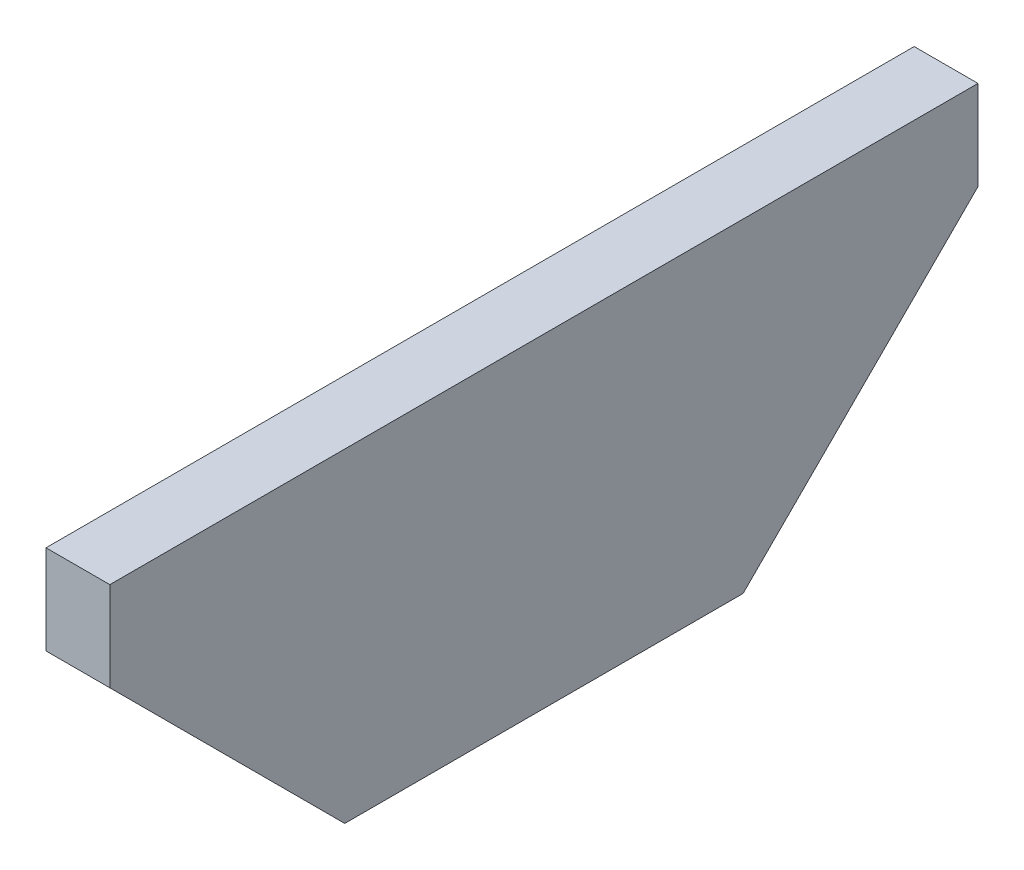
ISO-10303-21;
HEADER;
FILE_DESCRIPTION(('STEP AP214'),'2;1');
FILE_NAME('part.step','',(''),(''),'','','');
FILE_SCHEMA(('AUTOMOTIVE_DESIGN { 1 0 10303 214 1 1 1 1 }'));
ENDSEC;
DATA;
#1=APPLICATION_CONTEXT('core data for automotive mechanical design processes');
#2=APPLICATION_PROTOCOL_DEFINITION('international standard','automotive_design',2000,#1);
#3=PRODUCT_CONTEXT('',#1,'mechanical');
#4=PRODUCT('Part','Part','',(#3));
#5=PRODUCT_RELATED_PRODUCT_CATEGORY('part','',(#4));
#6=PRODUCT_DEFINITION_FORMATION('','',#4);
#7=PRODUCT_DEFINITION_CONTEXT('part definition',#1,'design');
#8=PRODUCT_DEFINITION('design','',#6,#7);
#9=PRODUCT_DEFINITION_SHAPE('','',#8);
#10=(LENGTH_UNIT() NAMED_UNIT(*) SI_UNIT(.MILLI.,.METRE.));
#11=(NAMED_UNIT(*) PLANE_ANGLE_UNIT() SI_UNIT($,.RADIAN.));
#12=(NAMED_UNIT(*) SI_UNIT($,.STERADIAN.) SOLID_ANGLE_UNIT());
#13=UNCERTAINTY_MEASURE_WITH_UNIT(LENGTH_MEASURE(1.E-05),#10,'distance_accuracy_value','');
#14=(GEOMETRIC_REPRESENTATION_CONTEXT(3) GLOBAL_UNCERTAINTY_ASSIGNED_CONTEXT((#13)) GLOBAL_UNIT_ASSIGNED_CONTEXT((#10,
#11,#12)) REPRESENTATION_CONTEXT('',''));
#15=CARTESIAN_POINT('',(0.,0.,0.));
#16=DIRECTION('',(0.,0.,1.));
#17=DIRECTION('',(1.,0.,0.));
#18=AXIS2_PLACEMENT_3D('',#15,#16,#17);
#19=CARTESIAN_POINT('',(-21.0781796503859,12.7,0.));
#20=DIRECTION('',(1.,0.,0.));
#21=DIRECTION('',(0.,0.,-1.));
#22=AXIS2_PLACEMENT_3D('',#19,#20,#21);
#23=PLANE('',#22);
#24=CARTESIAN_POINT('',(-21.0781796503859,9.2,-12.2941961802651));
#25=DIRECTION('',(1.,0.,0.));
#26=DIRECTION('',(0.,0.,-1.));
#27=AXIS2_PLACEMENT_3D('',#24,#25,#26);
#28=CIRCLE('',#27,1.75);
#29=CARTESIAN_POINT('',(-21.0781796503859,9.2,-14.0441961802651));
#30=VERTEX_POINT('',#29);
#31=EDGE_CURVE('E192',#30,#30,#28,.T.);
#32=ORIENTED_EDGE('',*,*,#31,.T.);
#33=EDGE_LOOP('',(#32));
#34=FACE_BOUND('',#33,.T.);
#35=CARTESIAN_POINT('',(-21.0781796503859,9.2,15.2058038197349));
#36=DIRECTION('',(1.,0.,0.));
#37=DIRECTION('',(0.,0.,-1.));
#38=AXIS2_PLACEMENT_3D('',#35,#36,#37);
#39=CIRCLE('',#38,1.75);
#40=CARTESIAN_POINT('',(-21.0781796503859,9.2,13.4558038197349));
#41=VERTEX_POINT('',#40);
#42=EDGE_CURVE('E195',#41,#41,#39,.T.);
#43=ORIENTED_EDGE('',*,*,#42,.T.);
#44=EDGE_LOOP('',(#43));
#45=FACE_BOUND('',#44,.T.);
#46=DIRECTION('',(0.,-0.707106781186551,-0.707106781186544));
#47=VECTOR('',#46,1.);
#48=CARTESIAN_POINT('',(-21.0781796503859,1.72209809013254,10.9779019098676));
#49=LINE('',#48,#47);
#50=CARTESIAN_POINT('',(-21.0781796503859,9.2,18.4558038197349));
#51=VERTEX_POINT('',#50);
#52=CARTESIAN_POINT('',(-21.0781796503859,0.,9.25580381973504));
#53=VERTEX_POINT('',#52);
#54=EDGE_CURVE('E105',#51,#53,#49,.T.);
#55=ORIENTED_EDGE('',*,*,#54,.F.);
#56=DIRECTION('',(0.,-1.,0.));
#57=VECTOR('',#56,1.);
#58=CARTESIAN_POINT('',(-21.0781796503859,12.7,18.4558038197349));
#59=LINE('',#58,#57);
#60=CARTESIAN_POINT('',(-21.0781796503859,12.7,18.4558038197349));
#61=VERTEX_POINT('',#60);
#62=EDGE_CURVE('E110',#61,#51,#59,.T.);
#63=ORIENTED_EDGE('',*,*,#62,.F.);
#64=DIRECTION('',(0.,0.,1.));
#65=VECTOR('',#64,1.);
#66=CARTESIAN_POINT('',(-21.0781796503859,12.7,0.));
#67=LINE('',#66,#65);
#68=CARTESIAN_POINT('',(-21.0781796503859,12.7,-15.5441961802651));
#69=VERTEX_POINT('',#68);
#70=EDGE_CURVE('E62',#69,#61,#67,.T.);
#71=ORIENTED_EDGE('',*,*,#70,.F.);
#72=DIRECTION('',(0.,-1.,0.));
#73=VECTOR('',#72,1.);
#74=CARTESIAN_POINT('',(-21.0781796503859,12.7,-15.5441961802651));
#75=LINE('',#74,#73);
#76=CARTESIAN_POINT('',(-21.0781796503859,9.2,-15.5441961802651));
#77=VERTEX_POINT('',#76);
#78=EDGE_CURVE('E11',#69,#77,#75,.T.);
#79=ORIENTED_EDGE('',*,*,#78,.T.);
#80=DIRECTION('',(0.,0.707106781186552,-0.707106781186543));
#81=VECTOR('',#80,1.);
#82=CARTESIAN_POINT('',(-21.0781796503859,9.2,-15.5441961802651));
#83=LINE('',#82,#81);
#84=CARTESIAN_POINT('',(-21.0781796503859,0.,-6.34419618026517));
#85=VERTEX_POINT('',#84);
#86=EDGE_CURVE('E51',#85,#77,#83,.T.);
#87=ORIENTED_EDGE('',*,*,#86,.F.);
#88=DIRECTION('',(0.,0.,1.));
#89=VECTOR('',#88,1.);
#90=CARTESIAN_POINT('',(-21.0781796503859,0.,0.));
#91=LINE('',#90,#89);
#92=EDGE_CURVE('E129',#85,#53,#91,.T.);
#93=ORIENTED_EDGE('',*,*,#92,.T.);
#94=EDGE_LOOP('',(#55,#63,#71,#79,#87,#93));
#95=FACE_BOUND('',#94,.T.);
#96=ADVANCED_FACE('F48',(#34,#45,#95),#23,.F.);
#97=CARTESIAN_POINT('',(0.,12.7,-15.5441961802651));
#98=DIRECTION('',(0.,0.,-1.));
#99=DIRECTION('',(-1.,0.,0.));
#100=AXIS2_PLACEMENT_3D('',#97,#98,#99);
#101=PLANE('',#100);
#102=ORIENTED_EDGE('',*,*,#78,.F.);
#103=DIRECTION('',(1.,0.,0.));
#104=VECTOR('',#103,1.);
#105=CARTESIAN_POINT('',(0.,12.7,-15.5441961802651));
#106=LINE('',#105,#104);
#107=CARTESIAN_POINT('',(-18.5781796503859,12.7,-15.5441961802651));
#108=VERTEX_POINT('',#107);
#109=EDGE_CURVE('E142',#69,#108,#106,.T.);
#110=ORIENTED_EDGE('',*,*,#109,.T.);
#111=DIRECTION('',(0.,-1.,0.));
#112=VECTOR('',#111,1.);
#113=CARTESIAN_POINT('',(-18.5781796503859,12.7,-15.5441961802651));
#114=LINE('',#113,#112);
#115=CARTESIAN_POINT('',(-18.5781796503859,9.2,-15.5441961802651));
#116=VERTEX_POINT('',#115);
#117=EDGE_CURVE('E138',#108,#116,#114,.T.);
#118=ORIENTED_EDGE('',*,*,#117,.T.);
#119=DIRECTION('',(1.,0.,0.));
#120=VECTOR('',#119,1.);
#121=CARTESIAN_POINT('',(-21.5781796503859,9.2,-15.5441961802651));
#122=LINE('',#121,#120);
#123=EDGE_CURVE('E208',#77,#116,#122,.T.);
#124=ORIENTED_EDGE('',*,*,#123,.F.);
#125=EDGE_LOOP('',(#102,#110,#118,#124));
#126=FACE_BOUND('',#125,.T.);
#127=ADVANCED_FACE('F165',(#126),#101,.T.);
#128=CARTESIAN_POINT('',(0.,12.7,18.4558038197349));
#129=DIRECTION('',(0.,0.,-1.));
#130=DIRECTION('',(-1.,0.,0.));
#131=AXIS2_PLACEMENT_3D('',#128,#129,#130);
#132=PLANE('',#131);
#133=DIRECTION('',(1.,0.,0.));
#134=VECTOR('',#133,1.);
#135=CARTESIAN_POINT('',(-21.5781796503859,9.2,18.4558038197349));
#136=LINE('',#135,#134);
#137=CARTESIAN_POINT('',(-18.5781796503859,9.2,18.4558038197349));
#138=VERTEX_POINT('',#137);
#139=EDGE_CURVE('E122',#51,#138,#136,.T.);
#140=ORIENTED_EDGE('',*,*,#139,.T.);
#141=DIRECTION('',(0.,-1.,0.));
#142=VECTOR('',#141,1.);
#143=CARTESIAN_POINT('',(-18.5781796503859,12.7,18.4558038197349));
#144=LINE('',#143,#142);
#145=CARTESIAN_POINT('',(-18.5781796503859,12.7,18.4558038197349));
#146=VERTEX_POINT('',#145);
#147=EDGE_CURVE('E120',#146,#138,#144,.T.);
#148=ORIENTED_EDGE('',*,*,#147,.F.);
#149=DIRECTION('',(1.,0.,0.));
#150=VECTOR('',#149,1.);
#151=CARTESIAN_POINT('',(0.,12.7,18.4558038197349));
#152=LINE('',#151,#150);
#153=EDGE_CURVE('E133',#61,#146,#152,.T.);
#154=ORIENTED_EDGE('',*,*,#153,.F.);
#155=ORIENTED_EDGE('',*,*,#62,.T.);
#156=EDGE_LOOP('',(#140,#148,#154,#155));
#157=FACE_BOUND('',#156,.T.);
#158=ADVANCED_FACE('F149',(#157),#132,.F.);
#159=CARTESIAN_POINT('',(-18.5781796503859,12.7,0.));
#160=DIRECTION('',(1.,0.,0.));
#161=DIRECTION('',(0.,0.,-1.));
#162=AXIS2_PLACEMENT_3D('',#159,#160,#161);
#163=PLANE('',#162);
#164=ORIENTED_EDGE('',*,*,#147,.T.);
#165=DIRECTION('',(0.,-0.707106781186551,-0.707106781186544));
#166=VECTOR('',#165,1.);
#167=CARTESIAN_POINT('',(-18.5781796503859,9.2,18.4558038197349));
#168=LINE('',#167,#166);
#169=CARTESIAN_POINT('',(-18.5781796503859,0.,9.25580381973504));
#170=VERTEX_POINT('',#169);
#171=EDGE_CURVE('E102',#138,#170,#168,.T.);
#172=ORIENTED_EDGE('',*,*,#171,.T.);
#173=DIRECTION('',(0.,0.,1.));
#174=VECTOR('',#173,1.);
#175=CARTESIAN_POINT('',(-18.5781796503859,0.,0.));
#176=LINE('',#175,#174);
#177=CARTESIAN_POINT('',(-18.5781796503859,0.,-6.34419618026517));
#178=VERTEX_POINT('',#177);
#179=EDGE_CURVE('E117',#178,#170,#176,.T.);
#180=ORIENTED_EDGE('',*,*,#179,.F.);
#181=DIRECTION('',(0.,-0.707106781186551,0.707106781186543));
#182=VECTOR('',#181,1.);
#183=CARTESIAN_POINT('',(-18.5781796503859,9.2,-15.5441961802651));
#184=LINE('',#183,#182);
#185=EDGE_CURVE('E123',#116,#178,#184,.T.);
#186=ORIENTED_EDGE('',*,*,#185,.F.);
#187=ORIENTED_EDGE('',*,*,#117,.F.);
#188=DIRECTION('',(0.,0.,1.));
#189=VECTOR('',#188,1.);
#190=CARTESIAN_POINT('',(-18.5781796503859,12.7,0.));
#191=LINE('',#190,#189);
#192=EDGE_CURVE('E159',#108,#146,#191,.T.);
#193=ORIENTED_EDGE('',*,*,#192,.T.);
#194=EDGE_LOOP('',(#164,#172,#180,#186,#187,#193));
#195=FACE_BOUND('',#194,.T.);
#196=ADVANCED_FACE('F115',(#195),#163,.T.);
#197=CARTESIAN_POINT('',(0.,0.,0.));
#198=DIRECTION('',(0.,1.,0.));
#199=DIRECTION('',(0.,0.,1.));
#200=AXIS2_PLACEMENT_3D('',#197,#198,#199);
#201=PLANE('',#200);
#202=ORIENTED_EDGE('',*,*,#92,.F.);
#203=DIRECTION('',(1.,0.,0.));
#204=VECTOR('',#203,1.);
#205=CARTESIAN_POINT('',(-21.5781796503859,0.,-6.34419618026517));
#206=LINE('',#205,#204);
#207=EDGE_CURVE('E126',#85,#178,#206,.T.);
#208=ORIENTED_EDGE('',*,*,#207,.T.);
#209=ORIENTED_EDGE('',*,*,#179,.T.);
#210=DIRECTION('',(1.,0.,0.));
#211=VECTOR('',#210,1.);
#212=CARTESIAN_POINT('',(0.,0.,9.25580381973504));
#213=LINE('',#212,#211);
#214=EDGE_CURVE('E99',#53,#170,#213,.T.);
#215=ORIENTED_EDGE('',*,*,#214,.F.);
#216=EDGE_LOOP('',(#202,#208,#209,#215));
#217=FACE_BOUND('',#216,.T.);
#218=ADVANCED_FACE('F125',(#217),#201,.F.);
#219=CARTESIAN_POINT('',(-21.5781796503859,9.2,18.4558038197349));
#220=DIRECTION('',(0.,-0.707106781186544,0.707106781186551));
#221=DIRECTION('',(0.,-0.707106781186551,-0.707106781186544));
#222=AXIS2_PLACEMENT_3D('',#219,#220,#221);
#223=PLANE('',#222);
#224=ORIENTED_EDGE('',*,*,#54,.T.);
#225=ORIENTED_EDGE('',*,*,#214,.T.);
#226=ORIENTED_EDGE('',*,*,#171,.F.);
#227=ORIENTED_EDGE('',*,*,#139,.F.);
#228=EDGE_LOOP('',(#224,#225,#226,#227));
#229=FACE_BOUND('',#228,.T.);
#230=ADVANCED_FACE('F101',(#229),#223,.T.);
#231=CARTESIAN_POINT('',(-21.5781796503859,9.2,-15.5441961802651));
#232=DIRECTION('',(0.,0.707106781186543,0.707106781186552));
#233=DIRECTION('',(0.,-0.707106781186552,0.707106781186543));
#234=AXIS2_PLACEMENT_3D('',#231,#232,#233);
#235=PLANE('',#234);
#236=ORIENTED_EDGE('',*,*,#207,.F.);
#237=ORIENTED_EDGE('',*,*,#86,.T.);
#238=ORIENTED_EDGE('',*,*,#123,.T.);
#239=ORIENTED_EDGE('',*,*,#185,.T.);
#240=EDGE_LOOP('',(#236,#237,#238,#239));
#241=FACE_BOUND('',#240,.T.);
#242=ADVANCED_FACE('F172',(#241),#235,.F.);
#243=CARTESIAN_POINT('',(0.,12.7,0.));
#244=DIRECTION('',(0.,1.,0.));
#245=DIRECTION('',(0.,0.,1.));
#246=AXIS2_PLACEMENT_3D('',#243,#244,#245);
#247=PLANE('',#246);
#248=ORIENTED_EDGE('',*,*,#109,.F.);
#249=ORIENTED_EDGE('',*,*,#70,.T.);
#250=ORIENTED_EDGE('',*,*,#153,.T.);
#251=ORIENTED_EDGE('',*,*,#192,.F.);
#252=EDGE_LOOP('',(#248,#249,#250,#251));
#253=FACE_BOUND('',#252,.T.);
#254=ADVANCED_FACE('F169',(#253),#247,.T.);
#255=CARTESIAN_POINT('',(-19.5781796503859,9.2,15.2058038197349));
#256=DIRECTION('',(-1.,0.,0.));
#257=DIRECTION('',(0.,0.,1.));
#258=AXIS2_PLACEMENT_3D('',#255,#256,#257);
#259=CYLINDRICAL_SURFACE('',#258,1.75);
#260=CARTESIAN_POINT('',(-19.5781796503859,9.2,15.2058038197349));
#261=DIRECTION('',(1.,0.,0.));
#262=DIRECTION('',(0.,0.,-1.));
#263=AXIS2_PLACEMENT_3D('',#260,#261,#262);
#264=CIRCLE('',#263,1.75);
#265=CARTESIAN_POINT('',(-19.5781796503859,9.2,13.4558038197349));
#266=VERTEX_POINT('',#265);
#267=EDGE_CURVE('E198',#266,#266,#264,.T.);
#268=ORIENTED_EDGE('',*,*,#267,.T.);
#269=EDGE_LOOP('',(#268));
#270=FACE_BOUND('',#269,.T.);
#271=ORIENTED_EDGE('',*,*,#42,.F.);
#272=EDGE_LOOP('',(#271));
#273=FACE_BOUND('',#272,.T.);
#274=ADVANCED_FACE('F171',(#270,#273),#259,.F.);
#275=CARTESIAN_POINT('',(-19.5781796503859,9.2,15.2058038197349));
#276=DIRECTION('',(1.,0.,0.));
#277=DIRECTION('',(0.,0.,-1.));
#278=AXIS2_PLACEMENT_3D('',#275,#276,#277);
#279=PLANE('',#278);
#280=ORIENTED_EDGE('',*,*,#267,.F.);
#281=EDGE_LOOP('',(#280));
#282=FACE_BOUND('',#281,.T.);
#283=ADVANCED_FACE('F178',(#282),#279,.F.);
#284=CARTESIAN_POINT('',(-19.5781796503859,9.2,-12.2941961802651));
#285=DIRECTION('',(-1.,0.,0.));
#286=DIRECTION('',(0.,0.,1.));
#287=AXIS2_PLACEMENT_3D('',#284,#285,#286);
#288=CYLINDRICAL_SURFACE('',#287,1.75);
#289=CARTESIAN_POINT('',(-19.5781796503859,9.2,-12.2941961802651));
#290=DIRECTION('',(1.,0.,0.));
#291=DIRECTION('',(0.,0.,-1.));
#292=AXIS2_PLACEMENT_3D('',#289,#290,#291);
#293=CIRCLE('',#292,1.75);
#294=CARTESIAN_POINT('',(-19.5781796503859,9.2,-14.0441961802651));
#295=VERTEX_POINT('',#294);
#296=EDGE_CURVE('E202',#295,#295,#293,.T.);
#297=ORIENTED_EDGE('',*,*,#296,.T.);
#298=EDGE_LOOP('',(#297));
#299=FACE_BOUND('',#298,.T.);
#300=ORIENTED_EDGE('',*,*,#31,.F.);
#301=EDGE_LOOP('',(#300));
#302=FACE_BOUND('',#301,.T.);
#303=ADVANCED_FACE('F215',(#299,#302),#288,.F.);
#304=CARTESIAN_POINT('',(-19.5781796503859,9.2,-12.2941961802651));
#305=DIRECTION('',(1.,0.,0.));
#306=DIRECTION('',(0.,0.,-1.));
#307=AXIS2_PLACEMENT_3D('',#304,#305,#306);
#308=PLANE('',#307);
#309=ORIENTED_EDGE('',*,*,#296,.F.);
#310=EDGE_LOOP('',(#309));
#311=FACE_BOUND('',#310,.T.);
#312=ADVANCED_FACE('F218',(#311),#308,.F.);
#313=CLOSED_SHELL('',(#96,#127,#158,#196,#218,#230,#242,#254,#274,#283,#303,#312));
#314=MANIFOLD_SOLID_BREP('B2',#313);
#315=ADVANCED_BREP_SHAPE_REPRESENTATION('',(#18,#314),#14);
#316=SHAPE_DEFINITION_REPRESENTATION(#9,#315);
ENDSEC;
END-ISO-10303-21;
